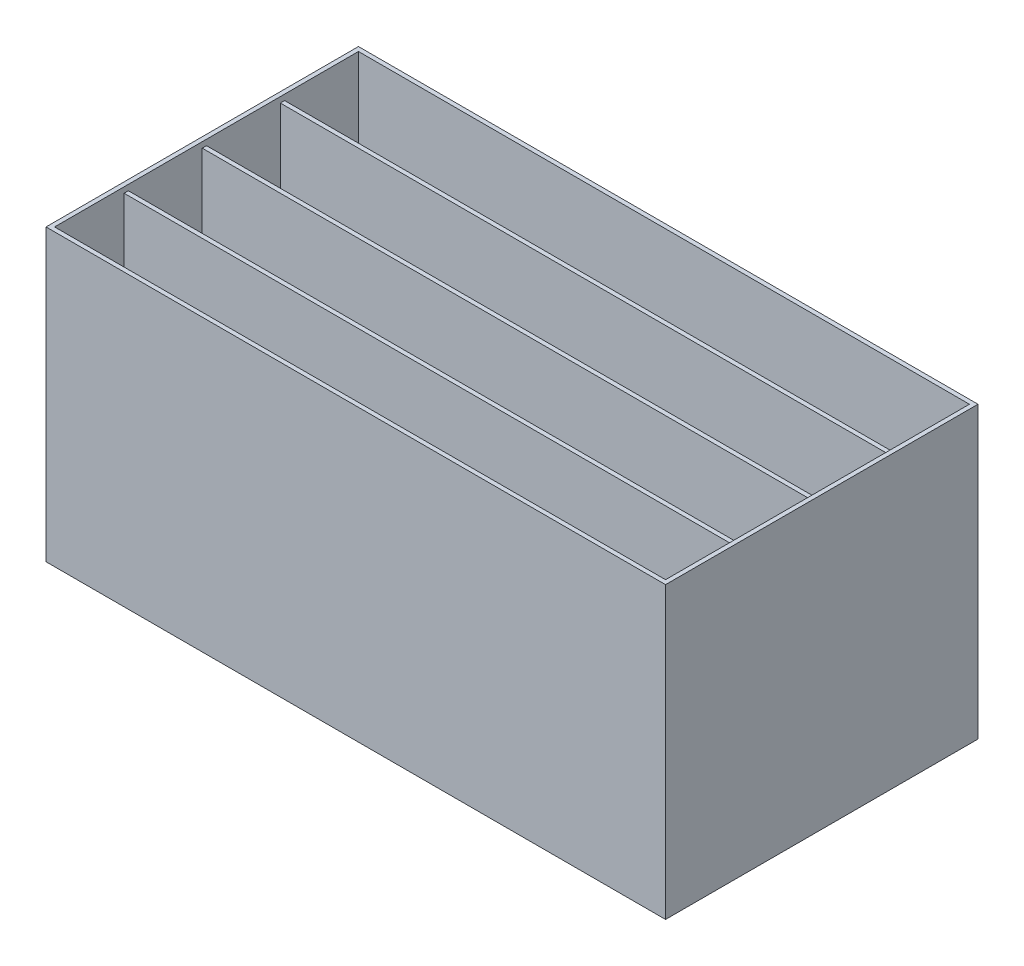
ISO-10303-21;
HEADER;
FILE_DESCRIPTION(('STEP AP214'),'2;1');
FILE_NAME('part.step','',(''),(''),'','','');
FILE_SCHEMA(('AUTOMOTIVE_DESIGN { 1 0 10303 214 1 1 1 1 }'));
ENDSEC;
DATA;
#1=APPLICATION_CONTEXT('core data for automotive mechanical design processes');
#2=APPLICATION_PROTOCOL_DEFINITION('international standard','automotive_design',2000,#1);
#3=PRODUCT_CONTEXT('',#1,'mechanical');
#4=PRODUCT('Part','Part','',(#3));
#5=PRODUCT_RELATED_PRODUCT_CATEGORY('part','',(#4));
#6=PRODUCT_DEFINITION_FORMATION('','',#4);
#7=PRODUCT_DEFINITION_CONTEXT('part definition',#1,'design');
#8=PRODUCT_DEFINITION('design','',#6,#7);
#9=PRODUCT_DEFINITION_SHAPE('','',#8);
#10=(LENGTH_UNIT() NAMED_UNIT(*) SI_UNIT(.MILLI.,.METRE.));
#11=(NAMED_UNIT(*) PLANE_ANGLE_UNIT() SI_UNIT($,.RADIAN.));
#12=(NAMED_UNIT(*) SI_UNIT($,.STERADIAN.) SOLID_ANGLE_UNIT());
#13=UNCERTAINTY_MEASURE_WITH_UNIT(LENGTH_MEASURE(1.E-05),#10,'distance_accuracy_value','');
#14=(GEOMETRIC_REPRESENTATION_CONTEXT(3) GLOBAL_UNCERTAINTY_ASSIGNED_CONTEXT((#13)) GLOBAL_UNIT_ASSIGNED_CONTEXT((#10,
#11,#12)) REPRESENTATION_CONTEXT('',''));
#15=CARTESIAN_POINT('',(0.,0.,0.));
#16=DIRECTION('',(0.,0.,1.));
#17=DIRECTION('',(1.,0.,0.));
#18=AXIS2_PLACEMENT_3D('',#15,#16,#17);
#19=CARTESIAN_POINT('',(6.35,430.2125,0.));
#20=DIRECTION('',(1.,0.,0.));
#21=DIRECTION('',(0.,0.,-1.));
#22=AXIS2_PLACEMENT_3D('',#19,#20,#21);
#23=PLANE('',#22);
#24=DIRECTION('',(0.,0.,1.));
#25=VECTOR('',#24,1.);
#26=CARTESIAN_POINT('',(6.35,421.894,-115.8875));
#27=LINE('',#26,#25);
#28=CARTESIAN_POINT('',(6.35,421.894,-115.8875));
#29=VERTEX_POINT('',#28);
#30=CARTESIAN_POINT('',(6.35,421.894,-109.5375));
#31=VERTEX_POINT('',#30);
#32=EDGE_CURVE('E58',#29,#31,#27,.T.);
#33=ORIENTED_EDGE('',*,*,#32,.F.);
#34=DIRECTION('',(0.,-1.,0.));
#35=VECTOR('',#34,1.);
#36=CARTESIAN_POINT('',(6.35,421.894,-115.8875));
#37=LINE('',#36,#35);
#38=CARTESIAN_POINT('',(6.35,6.35,-115.8875));
#39=VERTEX_POINT('',#38);
#40=EDGE_CURVE('E500',#29,#39,#37,.T.);
#41=ORIENTED_EDGE('',*,*,#40,.T.);
#42=DIRECTION('',(0.,0.,1.));
#43=VECTOR('',#42,1.);
#44=CARTESIAN_POINT('',(6.35,6.35,0.));
#45=LINE('',#44,#43);
#46=CARTESIAN_POINT('',(6.35,6.35,-225.425));
#47=VERTEX_POINT('',#46);
#48=EDGE_CURVE('E488',#47,#39,#45,.T.);
#49=ORIENTED_EDGE('',*,*,#48,.F.);
#50=DIRECTION('',(0.,-1.,0.));
#51=VECTOR('',#50,1.);
#52=CARTESIAN_POINT('',(6.35,421.894,-225.425));
#53=LINE('',#52,#51);
#54=CARTESIAN_POINT('',(6.35,421.894,-225.425));
#55=VERTEX_POINT('',#54);
#56=EDGE_CURVE('E207',#55,#47,#53,.T.);
#57=ORIENTED_EDGE('',*,*,#56,.F.);
#58=DIRECTION('',(0.,0.,1.));
#59=VECTOR('',#58,1.);
#60=CARTESIAN_POINT('',(6.35,421.894,-231.775));
#61=LINE('',#60,#59);
#62=CARTESIAN_POINT('',(6.35,421.894,-231.775));
#63=VERTEX_POINT('',#62);
#64=EDGE_CURVE('E228',#63,#55,#61,.T.);
#65=ORIENTED_EDGE('',*,*,#64,.F.);
#66=DIRECTION('',(0.,-1.,0.));
#67=VECTOR('',#66,1.);
#68=CARTESIAN_POINT('',(6.35,421.894,-231.775));
#69=LINE('',#68,#67);
#70=CARTESIAN_POINT('',(6.35,6.35,-231.775));
#71=VERTEX_POINT('',#70);
#72=EDGE_CURVE('E204',#63,#71,#69,.T.);
#73=ORIENTED_EDGE('',*,*,#72,.T.);
#74=CARTESIAN_POINT('',(6.35,6.35,-341.3125));
#75=VERTEX_POINT('',#74);
#76=EDGE_CURVE('E273',#75,#71,#45,.T.);
#77=ORIENTED_EDGE('',*,*,#76,.F.);
#78=DIRECTION('',(0.,-1.,0.));
#79=VECTOR('',#78,1.);
#80=CARTESIAN_POINT('',(6.35,421.894,-341.3125));
#81=LINE('',#80,#79);
#82=CARTESIAN_POINT('',(6.35,421.894,-341.3125));
#83=VERTEX_POINT('',#82);
#84=EDGE_CURVE('E267',#83,#75,#81,.T.);
#85=ORIENTED_EDGE('',*,*,#84,.F.);
#86=DIRECTION('',(0.,0.,1.));
#87=VECTOR('',#86,1.);
#88=CARTESIAN_POINT('',(6.35,421.894,-347.6625));
#89=LINE('',#88,#87);
#90=CARTESIAN_POINT('',(6.35,421.894,-347.6625));
#91=VERTEX_POINT('',#90);
#92=EDGE_CURVE('E246',#91,#83,#89,.T.);
#93=ORIENTED_EDGE('',*,*,#92,.F.);
#94=DIRECTION('',(0.,-1.,0.));
#95=VECTOR('',#94,1.);
#96=CARTESIAN_POINT('',(6.35,421.894,-347.6625));
#97=LINE('',#96,#95);
#98=CARTESIAN_POINT('',(6.35,6.35,-347.6625));
#99=VERTEX_POINT('',#98);
#100=EDGE_CURVE('E258',#91,#99,#97,.T.);
#101=ORIENTED_EDGE('',*,*,#100,.T.);
#102=CARTESIAN_POINT('',(6.35,6.35,-457.2));
#103=VERTEX_POINT('',#102);
#104=EDGE_CURVE('E271',#103,#99,#45,.T.);
#105=ORIENTED_EDGE('',*,*,#104,.F.);
#106=DIRECTION('',(0.,-1.,0.));
#107=VECTOR('',#106,1.);
#108=CARTESIAN_POINT('',(6.35,430.2125,-457.2));
#109=LINE('',#108,#107);
#110=CARTESIAN_POINT('',(6.35,430.2125,-457.2));
#111=VERTEX_POINT('',#110);
#112=EDGE_CURVE('E279',#111,#103,#109,.T.);
#113=ORIENTED_EDGE('',*,*,#112,.F.);
#114=DIRECTION('',(0.,0.,1.));
#115=VECTOR('',#114,1.);
#116=CARTESIAN_POINT('',(6.35,430.2125,0.));
#117=LINE('',#116,#115);
#118=CARTESIAN_POINT('',(6.35,430.2125,-6.35));
#119=VERTEX_POINT('',#118);
#120=EDGE_CURVE('E289',#111,#119,#117,.T.);
#121=ORIENTED_EDGE('',*,*,#120,.T.);
#122=DIRECTION('',(0.,-1.,0.));
#123=VECTOR('',#122,1.);
#124=CARTESIAN_POINT('',(6.35,430.2125,-6.35));
#125=LINE('',#124,#123);
#126=CARTESIAN_POINT('',(6.35,6.35,-6.35));
#127=VERTEX_POINT('',#126);
#128=EDGE_CURVE('E274',#119,#127,#125,.T.);
#129=ORIENTED_EDGE('',*,*,#128,.T.);
#130=CARTESIAN_POINT('',(6.35,6.35,-109.5375));
#131=VERTEX_POINT('',#130);
#132=EDGE_CURVE('E270',#131,#127,#45,.T.);
#133=ORIENTED_EDGE('',*,*,#132,.F.);
#134=DIRECTION('',(0.,-1.,0.));
#135=VECTOR('',#134,1.);
#136=CARTESIAN_POINT('',(6.35,421.894,-109.5375));
#137=LINE('',#136,#135);
#138=EDGE_CURVE('E63',#31,#131,#137,.T.);
#139=ORIENTED_EDGE('',*,*,#138,.F.);
#140=EDGE_LOOP('',(#33,#41,#49,#57,#65,#73,#77,#85,#93,#101,#105,#113,#121,#129,#133,#139));
#141=FACE_BOUND('',#140,.T.);
#142=ADVANCED_FACE('F43',(#141),#23,.T.);
#143=CARTESIAN_POINT('',(912.8125,430.2125,0.));
#144=DIRECTION('',(-1.,0.,0.));
#145=DIRECTION('',(0.,0.,1.));
#146=AXIS2_PLACEMENT_3D('',#143,#144,#145);
#147=PLANE('',#146);
#148=DIRECTION('',(0.,0.,-1.));
#149=VECTOR('',#148,1.);
#150=CARTESIAN_POINT('',(912.8125,6.35,0.));
#151=LINE('',#150,#149);
#152=CARTESIAN_POINT('',(912.8125,6.35,-115.8875));
#153=VERTEX_POINT('',#152);
#154=CARTESIAN_POINT('',(912.8125,6.35,-225.425));
#155=VERTEX_POINT('',#154);
#156=EDGE_CURVE('E189',#153,#155,#151,.T.);
#157=ORIENTED_EDGE('',*,*,#156,.F.);
#158=DIRECTION('',(0.,-1.,0.));
#159=VECTOR('',#158,1.);
#160=CARTESIAN_POINT('',(912.8125,421.894,-115.8875));
#161=LINE('',#160,#159);
#162=CARTESIAN_POINT('',(912.8125,421.894,-115.8875));
#163=VERTEX_POINT('',#162);
#164=EDGE_CURVE('E201',#163,#153,#161,.T.);
#165=ORIENTED_EDGE('',*,*,#164,.F.);
#166=DIRECTION('',(0.,0.,-1.));
#167=VECTOR('',#166,1.);
#168=CARTESIAN_POINT('',(912.8125,421.894,-115.8875));
#169=LINE('',#168,#167);
#170=CARTESIAN_POINT('',(912.8125,421.894,-109.5375));
#171=VERTEX_POINT('',#170);
#172=EDGE_CURVE('E197',#171,#163,#169,.T.);
#173=ORIENTED_EDGE('',*,*,#172,.F.);
#174=DIRECTION('',(0.,-1.,0.));
#175=VECTOR('',#174,1.);
#176=CARTESIAN_POINT('',(912.8125,421.894,-109.5375));
#177=LINE('',#176,#175);
#178=CARTESIAN_POINT('',(912.8125,6.35,-109.5375));
#179=VERTEX_POINT('',#178);
#180=EDGE_CURVE('E193',#171,#179,#177,.T.);
#181=ORIENTED_EDGE('',*,*,#180,.T.);
#182=CARTESIAN_POINT('',(912.8125,6.35,-6.35));
#183=VERTEX_POINT('',#182);
#184=EDGE_CURVE('E178',#183,#179,#151,.T.);
#185=ORIENTED_EDGE('',*,*,#184,.F.);
#186=DIRECTION('',(0.,-1.,0.));
#187=VECTOR('',#186,1.);
#188=CARTESIAN_POINT('',(912.8125,430.2125,-6.35));
#189=LINE('',#188,#187);
#190=CARTESIAN_POINT('',(912.8125,430.2125,-6.35));
#191=VERTEX_POINT('',#190);
#192=EDGE_CURVE('E278',#191,#183,#189,.T.);
#193=ORIENTED_EDGE('',*,*,#192,.F.);
#194=DIRECTION('',(0.,0.,-1.));
#195=VECTOR('',#194,1.);
#196=CARTESIAN_POINT('',(912.8125,430.2125,0.));
#197=LINE('',#196,#195);
#198=CARTESIAN_POINT('',(912.8125,430.2125,-457.2));
#199=VERTEX_POINT('',#198);
#200=EDGE_CURVE('E293',#191,#199,#197,.T.);
#201=ORIENTED_EDGE('',*,*,#200,.T.);
#202=DIRECTION('',(0.,-1.,0.));
#203=VECTOR('',#202,1.);
#204=CARTESIAN_POINT('',(912.8125,430.2125,-457.2));
#205=LINE('',#204,#203);
#206=CARTESIAN_POINT('',(912.8125,6.35,-457.2));
#207=VERTEX_POINT('',#206);
#208=EDGE_CURVE('E282',#199,#207,#205,.T.);
#209=ORIENTED_EDGE('',*,*,#208,.T.);
#210=CARTESIAN_POINT('',(912.8125,6.35,-347.6625));
#211=VERTEX_POINT('',#210);
#212=EDGE_CURVE('E191',#211,#207,#151,.T.);
#213=ORIENTED_EDGE('',*,*,#212,.F.);
#214=DIRECTION('',(0.,-1.,0.));
#215=VECTOR('',#214,1.);
#216=CARTESIAN_POINT('',(912.8125,421.894,-347.6625));
#217=LINE('',#216,#215);
#218=CARTESIAN_POINT('',(912.8125,421.894,-347.6625));
#219=VERTEX_POINT('',#218);
#220=EDGE_CURVE('E261',#219,#211,#217,.T.);
#221=ORIENTED_EDGE('',*,*,#220,.F.);
#222=DIRECTION('',(0.,0.,-1.));
#223=VECTOR('',#222,1.);
#224=CARTESIAN_POINT('',(912.8125,421.894,-347.6625));
#225=LINE('',#224,#223);
#226=CARTESIAN_POINT('',(912.8125,421.894,-341.3125));
#227=VERTEX_POINT('',#226);
#228=EDGE_CURVE('E252',#227,#219,#225,.T.);
#229=ORIENTED_EDGE('',*,*,#228,.F.);
#230=DIRECTION('',(0.,-1.,0.));
#231=VECTOR('',#230,1.);
#232=CARTESIAN_POINT('',(912.8125,421.894,-341.3125));
#233=LINE('',#232,#231);
#234=CARTESIAN_POINT('',(912.8125,6.35,-341.3125));
#235=VERTEX_POINT('',#234);
#236=EDGE_CURVE('E264',#227,#235,#233,.T.);
#237=ORIENTED_EDGE('',*,*,#236,.T.);
#238=CARTESIAN_POINT('',(912.8125,6.35,-231.775));
#239=VERTEX_POINT('',#238);
#240=EDGE_CURVE('E492',#239,#235,#151,.T.);
#241=ORIENTED_EDGE('',*,*,#240,.F.);
#242=DIRECTION('',(0.,-1.,0.));
#243=VECTOR('',#242,1.);
#244=CARTESIAN_POINT('',(912.8125,421.894,-231.775));
#245=LINE('',#244,#243);
#246=CARTESIAN_POINT('',(912.8125,421.894,-231.775));
#247=VERTEX_POINT('',#246);
#248=EDGE_CURVE('E219',#247,#239,#245,.T.);
#249=ORIENTED_EDGE('',*,*,#248,.F.);
#250=DIRECTION('',(0.,0.,-1.));
#251=VECTOR('',#250,1.);
#252=CARTESIAN_POINT('',(912.8125,421.894,-231.775));
#253=LINE('',#252,#251);
#254=CARTESIAN_POINT('',(912.8125,421.894,-225.425));
#255=VERTEX_POINT('',#254);
#256=EDGE_CURVE('E222',#255,#247,#253,.T.);
#257=ORIENTED_EDGE('',*,*,#256,.F.);
#258=DIRECTION('',(0.,-1.,0.));
#259=VECTOR('',#258,1.);
#260=CARTESIAN_POINT('',(912.8125,421.894,-225.425));
#261=LINE('',#260,#259);
#262=EDGE_CURVE('E216',#255,#155,#261,.T.);
#263=ORIENTED_EDGE('',*,*,#262,.T.);
#264=EDGE_LOOP('',(#157,#165,#173,#181,#185,#193,#201,#209,#213,#221,#229,#237,#241,#249,#257,#263));
#265=FACE_BOUND('',#264,.T.);
#266=ADVANCED_FACE('F195',(#265),#147,.T.);
#267=CARTESIAN_POINT('',(0.,6.35,0.));
#268=DIRECTION('',(0.,-1.,0.));
#269=DIRECTION('',(0.,0.,-1.));
#270=AXIS2_PLACEMENT_3D('',#267,#268,#269);
#271=PLANE('',#270);
#272=DIRECTION('',(-1.,0.,0.));
#273=VECTOR('',#272,1.);
#274=CARTESIAN_POINT('',(6.35,6.35,-115.8875));
#275=LINE('',#274,#273);
#276=EDGE_CURVE('E205',#153,#39,#275,.T.);
#277=ORIENTED_EDGE('',*,*,#276,.F.);
#278=ORIENTED_EDGE('',*,*,#156,.T.);
#279=DIRECTION('',(1.,0.,0.));
#280=VECTOR('',#279,1.);
#281=CARTESIAN_POINT('',(6.35,6.35,-225.425));
#282=LINE('',#281,#280);
#283=EDGE_CURVE('E237',#47,#155,#282,.T.);
#284=ORIENTED_EDGE('',*,*,#283,.F.);
#285=ORIENTED_EDGE('',*,*,#48,.T.);
#286=EDGE_LOOP('',(#277,#278,#284,#285));
#287=FACE_BOUND('',#286,.T.);
#288=ADVANCED_FACE('F356',(#287),#271,.F.);
#289=DIRECTION('',(1.,0.,0.));
#290=VECTOR('',#289,1.);
#291=CARTESIAN_POINT('',(6.35,6.35,-109.5375));
#292=LINE('',#291,#290);
#293=EDGE_CURVE('E182',#131,#179,#292,.T.);
#294=ORIENTED_EDGE('',*,*,#293,.F.);
#295=ORIENTED_EDGE('',*,*,#132,.T.);
#296=DIRECTION('',(1.,0.,0.));
#297=VECTOR('',#296,1.);
#298=CARTESIAN_POINT('',(0.,6.35,-6.35));
#299=LINE('',#298,#297);
#300=EDGE_CURVE('E184',#127,#183,#299,.T.);
#301=ORIENTED_EDGE('',*,*,#300,.T.);
#302=ORIENTED_EDGE('',*,*,#184,.T.);
#303=EDGE_LOOP('',(#294,#295,#301,#302));
#304=FACE_BOUND('',#303,.T.);
#305=ADVANCED_FACE('F180',(#304),#271,.F.);
#306=DIRECTION('',(-1.,0.,0.));
#307=VECTOR('',#306,1.);
#308=CARTESIAN_POINT('',(6.35,6.35,-231.775));
#309=LINE('',#308,#307);
#310=EDGE_CURVE('E234',#239,#71,#309,.T.);
#311=ORIENTED_EDGE('',*,*,#310,.F.);
#312=ORIENTED_EDGE('',*,*,#240,.T.);
#313=DIRECTION('',(1.,0.,0.));
#314=VECTOR('',#313,1.);
#315=CARTESIAN_POINT('',(6.35,6.35,-341.3125));
#316=LINE('',#315,#314);
#317=EDGE_CURVE('E243',#75,#235,#316,.T.);
#318=ORIENTED_EDGE('',*,*,#317,.F.);
#319=ORIENTED_EDGE('',*,*,#76,.T.);
#320=EDGE_LOOP('',(#311,#312,#318,#319));
#321=FACE_BOUND('',#320,.T.);
#322=ADVANCED_FACE('F369',(#321),#271,.F.);
#323=DIRECTION('',(-1.,0.,0.));
#324=VECTOR('',#323,1.);
#325=CARTESIAN_POINT('',(6.35,6.35,-347.6625));
#326=LINE('',#325,#324);
#327=EDGE_CURVE('E240',#211,#99,#326,.T.);
#328=ORIENTED_EDGE('',*,*,#327,.F.);
#329=ORIENTED_EDGE('',*,*,#212,.T.);
#330=DIRECTION('',(-1.,0.,0.));
#331=VECTOR('',#330,1.);
#332=CARTESIAN_POINT('',(0.,6.35,-457.2));
#333=LINE('',#332,#331);
#334=EDGE_CURVE('E188',#207,#103,#333,.T.);
#335=ORIENTED_EDGE('',*,*,#334,.T.);
#336=ORIENTED_EDGE('',*,*,#104,.T.);
#337=EDGE_LOOP('',(#328,#329,#335,#336));
#338=FACE_BOUND('',#337,.T.);
#339=ADVANCED_FACE('F372',(#338),#271,.F.);
#340=CARTESIAN_POINT('',(0.,430.2125,0.));
#341=DIRECTION('',(0.,-1.,0.));
#342=DIRECTION('',(0.,0.,-1.));
#343=AXIS2_PLACEMENT_3D('',#340,#341,#342);
#344=PLANE('',#343);
#345=DIRECTION('',(0.,0.,1.));
#346=VECTOR('',#345,1.);
#347=CARTESIAN_POINT('',(0.,430.2125,0.));
#348=LINE('',#347,#346);
#349=CARTESIAN_POINT('',(0.,430.2125,-463.55));
#350=VERTEX_POINT('',#349);
#351=CARTESIAN_POINT('',(0.,430.2125,0.));
#352=VERTEX_POINT('',#351);
#353=EDGE_CURVE('E298',#350,#352,#348,.T.);
#354=ORIENTED_EDGE('',*,*,#353,.T.);
#355=DIRECTION('',(1.,0.,0.));
#356=VECTOR('',#355,1.);
#357=CARTESIAN_POINT('',(0.,430.2125,0.));
#358=LINE('',#357,#356);
#359=CARTESIAN_POINT('',(919.1625,430.2125,0.));
#360=VERTEX_POINT('',#359);
#361=EDGE_CURVE('E301',#352,#360,#358,.T.);
#362=ORIENTED_EDGE('',*,*,#361,.T.);
#363=DIRECTION('',(0.,0.,-1.));
#364=VECTOR('',#363,1.);
#365=CARTESIAN_POINT('',(919.1625,430.2125,0.));
#366=LINE('',#365,#364);
#367=CARTESIAN_POINT('',(919.1625,430.2125,-463.55));
#368=VERTEX_POINT('',#367);
#369=EDGE_CURVE('E304',#360,#368,#366,.T.);
#370=ORIENTED_EDGE('',*,*,#369,.T.);
#371=DIRECTION('',(-1.,0.,0.));
#372=VECTOR('',#371,1.);
#373=CARTESIAN_POINT('',(0.,430.2125,-463.55));
#374=LINE('',#373,#372);
#375=EDGE_CURVE('E306',#368,#350,#374,.T.);
#376=ORIENTED_EDGE('',*,*,#375,.T.);
#377=EDGE_LOOP('',(#354,#362,#370,#376));
#378=FACE_BOUND('',#377,.T.);
#379=ORIENTED_EDGE('',*,*,#120,.F.);
#380=DIRECTION('',(-1.,0.,0.));
#381=VECTOR('',#380,1.);
#382=CARTESIAN_POINT('',(0.,430.2125,-457.2));
#383=LINE('',#382,#381);
#384=EDGE_CURVE('E283',#199,#111,#383,.T.);
#385=ORIENTED_EDGE('',*,*,#384,.F.);
#386=ORIENTED_EDGE('',*,*,#200,.F.);
#387=DIRECTION('',(1.,0.,0.));
#388=VECTOR('',#387,1.);
#389=CARTESIAN_POINT('',(0.,430.2125,-6.35));
#390=LINE('',#389,#388);
#391=EDGE_CURVE('E291',#119,#191,#390,.T.);
#392=ORIENTED_EDGE('',*,*,#391,.F.);
#393=EDGE_LOOP('',(#379,#385,#386,#392));
#394=FACE_BOUND('',#393,.T.);
#395=ADVANCED_FACE('F340',(#378,#394),#344,.F.);
#396=CARTESIAN_POINT('',(0.,430.2125,0.));
#397=DIRECTION('',(1.,0.,0.));
#398=DIRECTION('',(0.,0.,-1.));
#399=AXIS2_PLACEMENT_3D('',#396,#397,#398);
#400=PLANE('',#399);
#401=DIRECTION('',(0.,0.,1.));
#402=VECTOR('',#401,1.);
#403=CARTESIAN_POINT('',(0.,0.,0.));
#404=LINE('',#403,#402);
#405=CARTESIAN_POINT('',(0.,0.,-463.55));
#406=VERTEX_POINT('',#405);
#407=CARTESIAN_POINT('',(0.,0.,0.));
#408=VERTEX_POINT('',#407);
#409=EDGE_CURVE('E277',#406,#408,#404,.T.);
#410=ORIENTED_EDGE('',*,*,#409,.T.);
#411=DIRECTION('',(0.,-1.,0.));
#412=VECTOR('',#411,1.);
#413=CARTESIAN_POINT('',(0.,430.2125,0.));
#414=LINE('',#413,#412);
#415=EDGE_CURVE('E11',#352,#408,#414,.T.);
#416=ORIENTED_EDGE('',*,*,#415,.F.);
#417=ORIENTED_EDGE('',*,*,#353,.F.);
#418=DIRECTION('',(0.,-1.,0.));
#419=VECTOR('',#418,1.);
#420=CARTESIAN_POINT('',(0.,430.2125,-463.55));
#421=LINE('',#420,#419);
#422=EDGE_CURVE('E308',#350,#406,#421,.T.);
#423=ORIENTED_EDGE('',*,*,#422,.T.);
#424=EDGE_LOOP('',(#410,#416,#417,#423));
#425=FACE_BOUND('',#424,.T.);
#426=ADVANCED_FACE('F45',(#425),#400,.F.);
#427=CARTESIAN_POINT('',(0.,430.2125,0.));
#428=DIRECTION('',(0.,0.,-1.));
#429=DIRECTION('',(-1.,0.,0.));
#430=AXIS2_PLACEMENT_3D('',#427,#428,#429);
#431=PLANE('',#430);
#432=DIRECTION('',(1.,0.,0.));
#433=VECTOR('',#432,1.);
#434=CARTESIAN_POINT('',(0.,0.,0.));
#435=LINE('',#434,#433);
#436=CARTESIAN_POINT('',(919.1625,0.,0.));
#437=VERTEX_POINT('',#436);
#438=EDGE_CURVE('E311',#408,#437,#435,.T.);
#439=ORIENTED_EDGE('',*,*,#438,.T.);
#440=DIRECTION('',(0.,-1.,0.));
#441=VECTOR('',#440,1.);
#442=CARTESIAN_POINT('',(919.1625,430.2125,0.));
#443=LINE('',#442,#441);
#444=EDGE_CURVE('E51',#360,#437,#443,.T.);
#445=ORIENTED_EDGE('',*,*,#444,.F.);
#446=ORIENTED_EDGE('',*,*,#361,.F.);
#447=ORIENTED_EDGE('',*,*,#415,.T.);
#448=EDGE_LOOP('',(#439,#445,#446,#447));
#449=FACE_BOUND('',#448,.T.);
#450=ADVANCED_FACE('F342',(#449),#431,.F.);
#451=CARTESIAN_POINT('',(919.1625,430.2125,0.));
#452=DIRECTION('',(-1.,0.,0.));
#453=DIRECTION('',(0.,0.,1.));
#454=AXIS2_PLACEMENT_3D('',#451,#452,#453);
#455=PLANE('',#454);
#456=DIRECTION('',(0.,0.,-1.));
#457=VECTOR('',#456,1.);
#458=CARTESIAN_POINT('',(919.1625,0.,0.));
#459=LINE('',#458,#457);
#460=CARTESIAN_POINT('',(919.1625,0.,-463.55));
#461=VERTEX_POINT('',#460);
#462=EDGE_CURVE('E313',#437,#461,#459,.T.);
#463=ORIENTED_EDGE('',*,*,#462,.T.);
#464=DIRECTION('',(0.,-1.,0.));
#465=VECTOR('',#464,1.);
#466=CARTESIAN_POINT('',(919.1625,430.2125,-463.55));
#467=LINE('',#466,#465);
#468=EDGE_CURVE('E318',#368,#461,#467,.T.);
#469=ORIENTED_EDGE('',*,*,#468,.F.);
#470=ORIENTED_EDGE('',*,*,#369,.F.);
#471=ORIENTED_EDGE('',*,*,#444,.T.);
#472=EDGE_LOOP('',(#463,#469,#470,#471));
#473=FACE_BOUND('',#472,.T.);
#474=ADVANCED_FACE('F325',(#473),#455,.F.);
#475=CARTESIAN_POINT('',(0.,430.2125,-463.55));
#476=DIRECTION('',(0.,0.,1.));
#477=DIRECTION('',(1.,0.,0.));
#478=AXIS2_PLACEMENT_3D('',#475,#476,#477);
#479=PLANE('',#478);
#480=DIRECTION('',(-1.,0.,0.));
#481=VECTOR('',#480,1.);
#482=CARTESIAN_POINT('',(0.,0.,-463.55));
#483=LINE('',#482,#481);
#484=EDGE_CURVE('E302',#461,#406,#483,.T.);
#485=ORIENTED_EDGE('',*,*,#484,.T.);
#486=ORIENTED_EDGE('',*,*,#422,.F.);
#487=ORIENTED_EDGE('',*,*,#375,.F.);
#488=ORIENTED_EDGE('',*,*,#468,.T.);
#489=EDGE_LOOP('',(#485,#486,#487,#488));
#490=FACE_BOUND('',#489,.T.);
#491=ADVANCED_FACE('F334',(#490),#479,.F.);
#492=CARTESIAN_POINT('',(0.,0.,0.));
#493=DIRECTION('',(0.,-1.,0.));
#494=DIRECTION('',(0.,0.,-1.));
#495=AXIS2_PLACEMENT_3D('',#492,#493,#494);
#496=PLANE('',#495);
#497=ORIENTED_EDGE('',*,*,#409,.F.);
#498=ORIENTED_EDGE('',*,*,#484,.F.);
#499=ORIENTED_EDGE('',*,*,#462,.F.);
#500=ORIENTED_EDGE('',*,*,#438,.F.);
#501=EDGE_LOOP('',(#497,#498,#499,#500));
#502=FACE_BOUND('',#501,.T.);
#503=ADVANCED_FACE('F331',(#502),#496,.T.);
#504=CARTESIAN_POINT('',(0.,430.2125,-6.35));
#505=DIRECTION('',(0.,0.,-1.));
#506=DIRECTION('',(-1.,0.,0.));
#507=AXIS2_PLACEMENT_3D('',#504,#505,#506);
#508=PLANE('',#507);
#509=ORIENTED_EDGE('',*,*,#300,.F.);
#510=ORIENTED_EDGE('',*,*,#128,.F.);
#511=ORIENTED_EDGE('',*,*,#391,.T.);
#512=ORIENTED_EDGE('',*,*,#192,.T.);
#513=EDGE_LOOP('',(#509,#510,#511,#512));
#514=FACE_BOUND('',#513,.T.);
#515=ADVANCED_FACE('F362',(#514),#508,.T.);
#516=CARTESIAN_POINT('',(0.,430.2125,-457.2));
#517=DIRECTION('',(0.,0.,1.));
#518=DIRECTION('',(1.,0.,0.));
#519=AXIS2_PLACEMENT_3D('',#516,#517,#518);
#520=PLANE('',#519);
#521=ORIENTED_EDGE('',*,*,#334,.F.);
#522=ORIENTED_EDGE('',*,*,#208,.F.);
#523=ORIENTED_EDGE('',*,*,#384,.T.);
#524=ORIENTED_EDGE('',*,*,#112,.T.);
#525=EDGE_LOOP('',(#521,#522,#523,#524));
#526=FACE_BOUND('',#525,.T.);
#527=ADVANCED_FACE('F363',(#526),#520,.T.);
#528=CARTESIAN_POINT('',(6.35,421.894,-341.3125));
#529=DIRECTION('',(0.,0.,-1.));
#530=DIRECTION('',(-1.,0.,0.));
#531=AXIS2_PLACEMENT_3D('',#528,#529,#530);
#532=PLANE('',#531);
#533=ORIENTED_EDGE('',*,*,#84,.T.);
#534=ORIENTED_EDGE('',*,*,#317,.T.);
#535=ORIENTED_EDGE('',*,*,#236,.F.);
#536=DIRECTION('',(1.,0.,0.));
#537=VECTOR('',#536,1.);
#538=CARTESIAN_POINT('',(6.35,421.894,-341.3125));
#539=LINE('',#538,#537);
#540=EDGE_CURVE('E249',#83,#227,#539,.T.);
#541=ORIENTED_EDGE('',*,*,#540,.F.);
#542=EDGE_LOOP('',(#533,#534,#535,#541));
#543=FACE_BOUND('',#542,.T.);
#544=ADVANCED_FACE('F360',(#543),#532,.F.);
#545=CARTESIAN_POINT('',(6.35,421.894,-347.6625));
#546=DIRECTION('',(0.,0.,1.));
#547=DIRECTION('',(1.,0.,0.));
#548=AXIS2_PLACEMENT_3D('',#545,#546,#547);
#549=PLANE('',#548);
#550=ORIENTED_EDGE('',*,*,#220,.T.);
#551=ORIENTED_EDGE('',*,*,#327,.T.);
#552=ORIENTED_EDGE('',*,*,#100,.F.);
#553=DIRECTION('',(-1.,0.,0.));
#554=VECTOR('',#553,1.);
#555=CARTESIAN_POINT('',(6.35,421.894,-347.6625));
#556=LINE('',#555,#554);
#557=EDGE_CURVE('E255',#219,#91,#556,.T.);
#558=ORIENTED_EDGE('',*,*,#557,.F.);
#559=EDGE_LOOP('',(#550,#551,#552,#558));
#560=FACE_BOUND('',#559,.T.);
#561=ADVANCED_FACE('F391',(#560),#549,.F.);
#562=CARTESIAN_POINT('',(0.,421.894,0.));
#563=DIRECTION('',(0.,1.,0.));
#564=DIRECTION('',(0.,0.,1.));
#565=AXIS2_PLACEMENT_3D('',#562,#563,#564);
#566=PLANE('',#565);
#567=ORIENTED_EDGE('',*,*,#92,.T.);
#568=ORIENTED_EDGE('',*,*,#540,.T.);
#569=ORIENTED_EDGE('',*,*,#228,.T.);
#570=ORIENTED_EDGE('',*,*,#557,.T.);
#571=EDGE_LOOP('',(#567,#568,#569,#570));
#572=FACE_BOUND('',#571,.T.);
#573=ADVANCED_FACE('F399',(#572),#566,.T.);
#574=CARTESIAN_POINT('',(6.35,421.894,-231.775));
#575=DIRECTION('',(0.,0.,1.));
#576=DIRECTION('',(1.,0.,0.));
#577=AXIS2_PLACEMENT_3D('',#574,#575,#576);
#578=PLANE('',#577);
#579=ORIENTED_EDGE('',*,*,#248,.T.);
#580=ORIENTED_EDGE('',*,*,#310,.T.);
#581=ORIENTED_EDGE('',*,*,#72,.F.);
#582=DIRECTION('',(-1.,0.,0.));
#583=VECTOR('',#582,1.);
#584=CARTESIAN_POINT('',(6.35,421.894,-231.775));
#585=LINE('',#584,#583);
#586=EDGE_CURVE('E231',#247,#63,#585,.T.);
#587=ORIENTED_EDGE('',*,*,#586,.F.);
#588=EDGE_LOOP('',(#579,#580,#581,#587));
#589=FACE_BOUND('',#588,.T.);
#590=ADVANCED_FACE('F407',(#589),#578,.F.);
#591=CARTESIAN_POINT('',(6.35,421.894,-225.425));
#592=DIRECTION('',(0.,0.,-1.));
#593=DIRECTION('',(-1.,0.,0.));
#594=AXIS2_PLACEMENT_3D('',#591,#592,#593);
#595=PLANE('',#594);
#596=ORIENTED_EDGE('',*,*,#56,.T.);
#597=ORIENTED_EDGE('',*,*,#283,.T.);
#598=ORIENTED_EDGE('',*,*,#262,.F.);
#599=DIRECTION('',(1.,0.,0.));
#600=VECTOR('',#599,1.);
#601=CARTESIAN_POINT('',(6.35,421.894,-225.425));
#602=LINE('',#601,#600);
#603=EDGE_CURVE('E225',#55,#255,#602,.T.);
#604=ORIENTED_EDGE('',*,*,#603,.F.);
#605=EDGE_LOOP('',(#596,#597,#598,#604));
#606=FACE_BOUND('',#605,.T.);
#607=ADVANCED_FACE('F416',(#606),#595,.F.);
#608=CARTESIAN_POINT('',(0.,421.894,0.));
#609=DIRECTION('',(0.,-1.,0.));
#610=DIRECTION('',(0.,0.,-1.));
#611=AXIS2_PLACEMENT_3D('',#608,#609,#610);
#612=PLANE('',#611);
#613=ORIENTED_EDGE('',*,*,#586,.T.);
#614=ORIENTED_EDGE('',*,*,#64,.T.);
#615=ORIENTED_EDGE('',*,*,#603,.T.);
#616=ORIENTED_EDGE('',*,*,#256,.T.);
#617=EDGE_LOOP('',(#613,#614,#615,#616));
#618=FACE_BOUND('',#617,.T.);
#619=ADVANCED_FACE('F425',(#618),#612,.F.);
#620=CARTESIAN_POINT('',(6.35,421.894,-115.8875));
#621=DIRECTION('',(0.,0.,1.));
#622=DIRECTION('',(1.,0.,0.));
#623=AXIS2_PLACEMENT_3D('',#620,#621,#622);
#624=PLANE('',#623);
#625=ORIENTED_EDGE('',*,*,#164,.T.);
#626=ORIENTED_EDGE('',*,*,#276,.T.);
#627=ORIENTED_EDGE('',*,*,#40,.F.);
#628=DIRECTION('',(-1.,0.,0.));
#629=VECTOR('',#628,1.);
#630=CARTESIAN_POINT('',(6.35,421.894,-115.8875));
#631=LINE('',#630,#629);
#632=EDGE_CURVE('E210',#163,#29,#631,.T.);
#633=ORIENTED_EDGE('',*,*,#632,.F.);
#634=EDGE_LOOP('',(#625,#626,#627,#633));
#635=FACE_BOUND('',#634,.T.);
#636=ADVANCED_FACE('F434',(#635),#624,.F.);
#637=CARTESIAN_POINT('',(6.35,421.894,-109.5375));
#638=DIRECTION('',(0.,0.,-1.));
#639=DIRECTION('',(-1.,0.,0.));
#640=AXIS2_PLACEMENT_3D('',#637,#638,#639);
#641=PLANE('',#640);
#642=ORIENTED_EDGE('',*,*,#138,.T.);
#643=ORIENTED_EDGE('',*,*,#293,.T.);
#644=ORIENTED_EDGE('',*,*,#180,.F.);
#645=DIRECTION('',(1.,0.,0.));
#646=VECTOR('',#645,1.);
#647=CARTESIAN_POINT('',(6.35,421.894,-109.5375));
#648=LINE('',#647,#646);
#649=EDGE_CURVE('E495',#31,#171,#648,.T.);
#650=ORIENTED_EDGE('',*,*,#649,.F.);
#651=EDGE_LOOP('',(#642,#643,#644,#650));
#652=FACE_BOUND('',#651,.T.);
#653=ADVANCED_FACE('F203',(#652),#641,.F.);
#654=CARTESIAN_POINT('',(0.,421.894,0.));
#655=DIRECTION('',(0.,-1.,0.));
#656=DIRECTION('',(0.,0.,-1.));
#657=AXIS2_PLACEMENT_3D('',#654,#655,#656);
#658=PLANE('',#657);
#659=ORIENTED_EDGE('',*,*,#632,.T.);
#660=ORIENTED_EDGE('',*,*,#32,.T.);
#661=ORIENTED_EDGE('',*,*,#649,.T.);
#662=ORIENTED_EDGE('',*,*,#172,.T.);
#663=EDGE_LOOP('',(#659,#660,#661,#662));
#664=FACE_BOUND('',#663,.T.);
#665=ADVANCED_FACE('F451',(#664),#658,.F.);
#666=CLOSED_SHELL('',(#142,#266,#288,#305,#322,#339,#395,#426,#450,#474,#491,#503,#515,#527,
#544,#561,#573,#590,#607,#619,#636,#653,#665));
#667=MANIFOLD_SOLID_BREP('B2',#666);
#668=ADVANCED_BREP_SHAPE_REPRESENTATION('',(#18,#667),#14);
#669=SHAPE_DEFINITION_REPRESENTATION(#9,#668);
ENDSEC;
END-ISO-10303-21;
